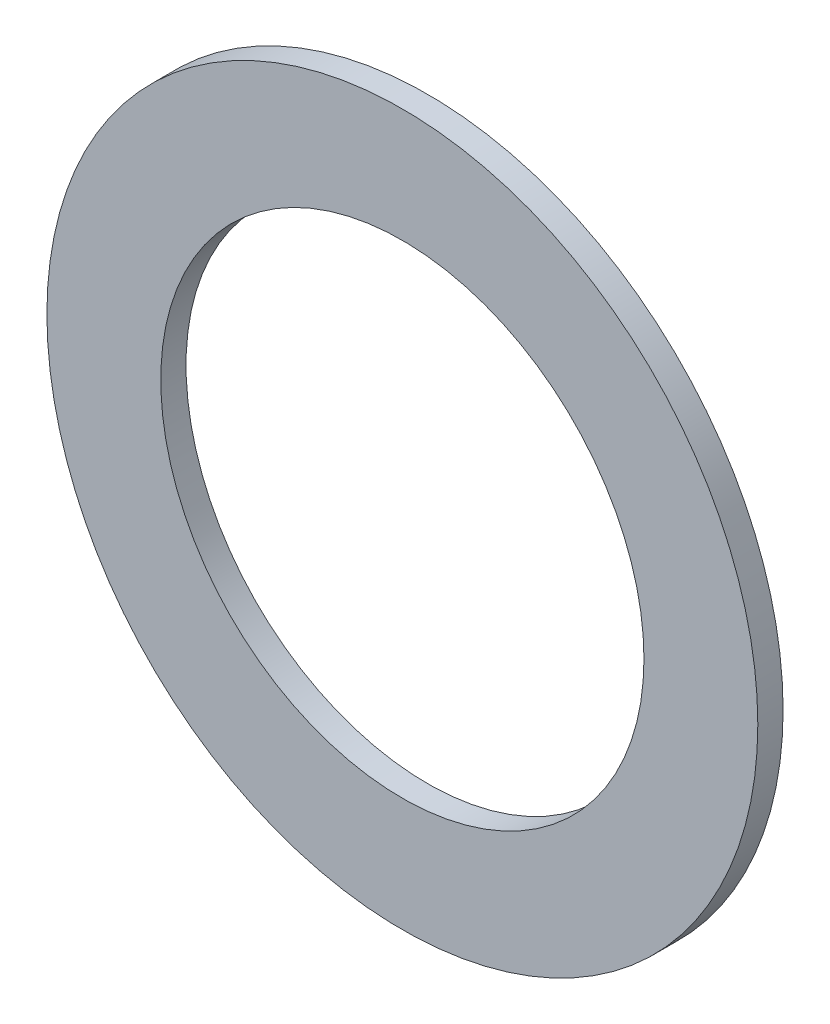
ISO-10303-21;
HEADER;
FILE_DESCRIPTION(('STEP AP214'),'2;1');
FILE_NAME('part.step','',(''),(''),'','','');
FILE_SCHEMA(('AUTOMOTIVE_DESIGN { 1 0 10303 214 1 1 1 1 }'));
ENDSEC;
DATA;
#1=APPLICATION_CONTEXT('core data for automotive mechanical design processes');
#2=APPLICATION_PROTOCOL_DEFINITION('international standard','automotive_design',2000,#1);
#3=PRODUCT_CONTEXT('',#1,'mechanical');
#4=PRODUCT('Part','Part','',(#3));
#5=PRODUCT_RELATED_PRODUCT_CATEGORY('part','',(#4));
#6=PRODUCT_DEFINITION_FORMATION('','',#4);
#7=PRODUCT_DEFINITION_CONTEXT('part definition',#1,'design');
#8=PRODUCT_DEFINITION('design','',#6,#7);
#9=PRODUCT_DEFINITION_SHAPE('','',#8);
#10=(LENGTH_UNIT() NAMED_UNIT(*) SI_UNIT(.MILLI.,.METRE.));
#11=(NAMED_UNIT(*) PLANE_ANGLE_UNIT() SI_UNIT($,.RADIAN.));
#12=(NAMED_UNIT(*) SI_UNIT($,.STERADIAN.) SOLID_ANGLE_UNIT());
#13=UNCERTAINTY_MEASURE_WITH_UNIT(LENGTH_MEASURE(1.E-05),#10,'distance_accuracy_value','');
#14=(GEOMETRIC_REPRESENTATION_CONTEXT(3) GLOBAL_UNCERTAINTY_ASSIGNED_CONTEXT((#13)) GLOBAL_UNIT_ASSIGNED_CONTEXT((#10,
#11,#12)) REPRESENTATION_CONTEXT('',''));
#15=CARTESIAN_POINT('',(0.,0.,0.));
#16=DIRECTION('',(0.,0.,1.));
#17=DIRECTION('',(1.,0.,0.));
#18=AXIS2_PLACEMENT_3D('',#15,#16,#17);
#19=CARTESIAN_POINT('',(0.,0.,9.1));
#20=DIRECTION('',(0.,0.,1.));
#21=DIRECTION('',(1.,0.,0.));
#22=AXIS2_PLACEMENT_3D('',#19,#20,#21);
#23=PLANE('',#22);
#24=CARTESIAN_POINT('',(0.,0.,9.1));
#25=DIRECTION('',(0.,0.,1.));
#26=DIRECTION('',(1.,0.,0.));
#27=AXIS2_PLACEMENT_3D('',#24,#25,#26);
#28=CIRCLE('',#27,128.);
#29=CARTESIAN_POINT('',(128.,0.,9.1));
#30=VERTEX_POINT('',#29);
#31=EDGE_CURVE('E11',#30,#30,#28,.T.);
#32=ORIENTED_EDGE('',*,*,#31,.T.);
#33=EDGE_LOOP('',(#32));
#34=FACE_BOUND('',#33,.T.);
#35=CARTESIAN_POINT('',(0.,0.,9.1));
#36=DIRECTION('',(0.,0.,1.));
#37=DIRECTION('',(1.,0.,0.));
#38=AXIS2_PLACEMENT_3D('',#35,#36,#37);
#39=CIRCLE('',#38,87.);
#40=CARTESIAN_POINT('',(87.,0.,9.1));
#41=VERTEX_POINT('',#40);
#42=EDGE_CURVE('E50',#41,#41,#39,.T.);
#43=ORIENTED_EDGE('',*,*,#42,.F.);
#44=EDGE_LOOP('',(#43));
#45=FACE_BOUND('',#44,.T.);
#46=ADVANCED_FACE('F39',(#34,#45),#23,.T.);
#47=CARTESIAN_POINT('',(0.,0.,0.));
#48=DIRECTION('',(0.,0.,1.));
#49=DIRECTION('',(1.,0.,0.));
#50=AXIS2_PLACEMENT_3D('',#47,#48,#49);
#51=PLANE('',#50);
#52=CARTESIAN_POINT('',(0.,0.,0.));
#53=DIRECTION('',(0.,0.,1.));
#54=DIRECTION('',(1.,0.,0.));
#55=AXIS2_PLACEMENT_3D('',#52,#53,#54);
#56=CIRCLE('',#55,128.);
#57=CARTESIAN_POINT('',(128.,0.,0.));
#58=VERTEX_POINT('',#57);
#59=EDGE_CURVE('E43',#58,#58,#56,.T.);
#60=ORIENTED_EDGE('',*,*,#59,.F.);
#61=EDGE_LOOP('',(#60));
#62=FACE_BOUND('',#61,.T.);
#63=CARTESIAN_POINT('',(0.,0.,0.));
#64=DIRECTION('',(0.,0.,1.));
#65=DIRECTION('',(1.,0.,0.));
#66=AXIS2_PLACEMENT_3D('',#63,#64,#65);
#67=CIRCLE('',#66,87.);
#68=CARTESIAN_POINT('',(87.,0.,0.));
#69=VERTEX_POINT('',#68);
#70=EDGE_CURVE('E52',#69,#69,#67,.T.);
#71=ORIENTED_EDGE('',*,*,#70,.T.);
#72=EDGE_LOOP('',(#71));
#73=FACE_BOUND('',#72,.T.);
#74=ADVANCED_FACE('F62',(#62,#73),#51,.F.);
#75=CARTESIAN_POINT('',(0.,0.,9.1));
#76=DIRECTION('',(0.,0.,-1.));
#77=DIRECTION('',(-1.,0.,0.));
#78=AXIS2_PLACEMENT_3D('',#75,#76,#77);
#79=CYLINDRICAL_SURFACE('',#78,128.);
#80=ORIENTED_EDGE('',*,*,#31,.F.);
#81=EDGE_LOOP('',(#80));
#82=FACE_BOUND('',#81,.T.);
#83=ORIENTED_EDGE('',*,*,#59,.T.);
#84=EDGE_LOOP('',(#83));
#85=FACE_BOUND('',#84,.T.);
#86=ADVANCED_FACE('F41',(#82,#85),#79,.T.);
#87=CARTESIAN_POINT('',(0.,0.,9.1));
#88=DIRECTION('',(0.,0.,-1.));
#89=DIRECTION('',(-1.,0.,0.));
#90=AXIS2_PLACEMENT_3D('',#87,#88,#89);
#91=CYLINDRICAL_SURFACE('',#90,87.);
#92=ORIENTED_EDGE('',*,*,#42,.T.);
#93=EDGE_LOOP('',(#92));
#94=FACE_BOUND('',#93,.T.);
#95=ORIENTED_EDGE('',*,*,#70,.F.);
#96=EDGE_LOOP('',(#95));
#97=FACE_BOUND('',#96,.T.);
#98=ADVANCED_FACE('F58',(#94,#97),#91,.F.);
#99=CLOSED_SHELL('',(#46,#74,#86,#98));
#100=MANIFOLD_SOLID_BREP('B2',#99);
#101=ADVANCED_BREP_SHAPE_REPRESENTATION('',(#18,#100),#14);
#102=SHAPE_DEFINITION_REPRESENTATION(#9,#101);
ENDSEC;
END-ISO-10303-21;
